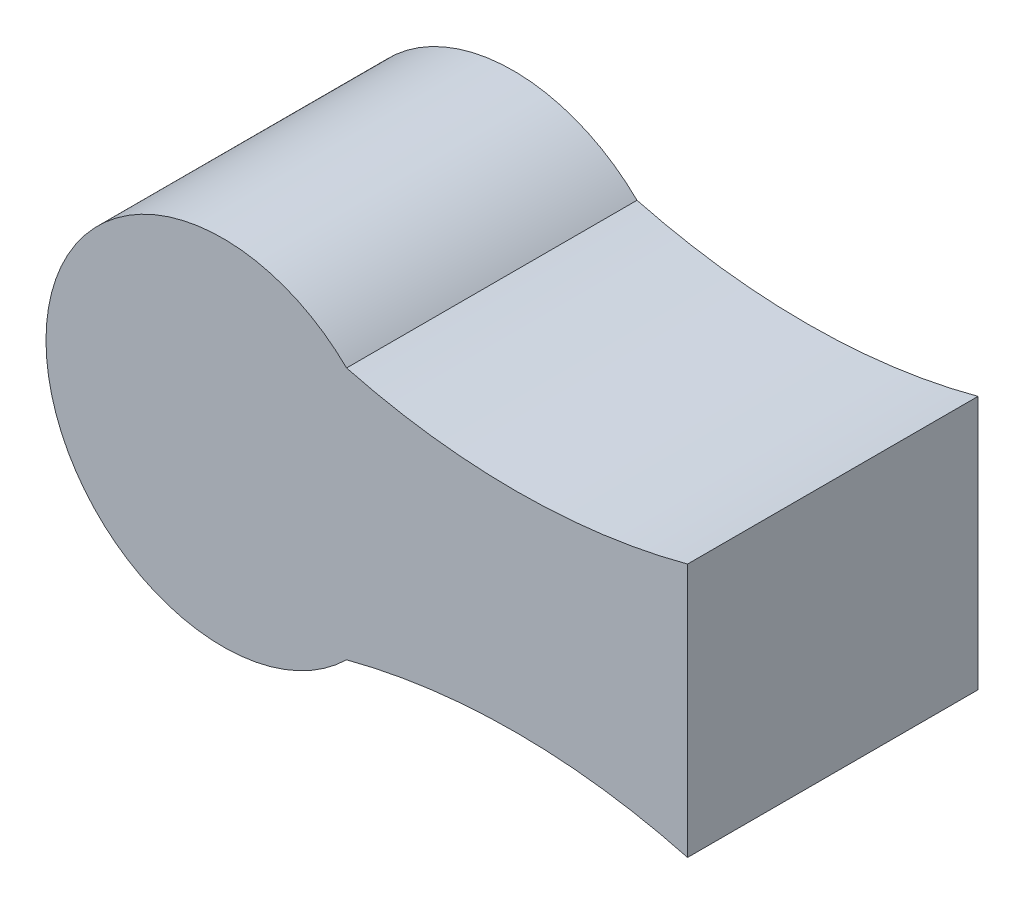
ISO-10303-21;
HEADER;
FILE_DESCRIPTION(('STEP AP214'),'2;1');
FILE_NAME('part.step','',(''),(''),'','','');
FILE_SCHEMA(('AUTOMOTIVE_DESIGN { 1 0 10303 214 1 1 1 1 }'));
ENDSEC;
DATA;
#1=APPLICATION_CONTEXT('core data for automotive mechanical design processes');
#2=APPLICATION_PROTOCOL_DEFINITION('international standard','automotive_design',2000,#1);
#3=PRODUCT_CONTEXT('',#1,'mechanical');
#4=PRODUCT('Part','Part','',(#3));
#5=PRODUCT_RELATED_PRODUCT_CATEGORY('part','',(#4));
#6=PRODUCT_DEFINITION_FORMATION('','',#4);
#7=PRODUCT_DEFINITION_CONTEXT('part definition',#1,'design');
#8=PRODUCT_DEFINITION('design','',#6,#7);
#9=PRODUCT_DEFINITION_SHAPE('','',#8);
#10=(LENGTH_UNIT() NAMED_UNIT(*) SI_UNIT(.MILLI.,.METRE.));
#11=(NAMED_UNIT(*) PLANE_ANGLE_UNIT() SI_UNIT($,.RADIAN.));
#12=(NAMED_UNIT(*) SI_UNIT($,.STERADIAN.) SOLID_ANGLE_UNIT());
#13=UNCERTAINTY_MEASURE_WITH_UNIT(LENGTH_MEASURE(1.E-05),#10,'distance_accuracy_value','');
#14=(GEOMETRIC_REPRESENTATION_CONTEXT(3) GLOBAL_UNCERTAINTY_ASSIGNED_CONTEXT((#13)) GLOBAL_UNIT_ASSIGNED_CONTEXT((#10,
#11,#12)) REPRESENTATION_CONTEXT('',''));
#15=CARTESIAN_POINT('',(0.,0.,0.));
#16=DIRECTION('',(0.,0.,1.));
#17=DIRECTION('',(1.,0.,0.));
#18=AXIS2_PLACEMENT_3D('',#15,#16,#17);
#19=CARTESIAN_POINT('',(128.170032982841,222.810691970387,80.));
#20=DIRECTION('',(0.,0.,-1.));
#21=DIRECTION('',(-1.,0.,0.));
#22=AXIS2_PLACEMENT_3D('',#19,#20,#21);
#23=CYLINDRICAL_SURFACE('',#22,183.196653412925);
#24=CARTESIAN_POINT('',(128.170032982841,222.810691970387,0.));
#25=DIRECTION('',(0.,0.,-1.));
#26=DIRECTION('',(-1.,0.,0.));
#27=AXIS2_PLACEMENT_3D('',#24,#25,#26);
#28=CIRCLE('',#27,183.196653412925);
#29=CARTESIAN_POINT('',(175.492718801523,45.8316614933225,0.));
#30=VERTEX_POINT('',#29);
#31=CARTESIAN_POINT('',(81.5700210476364,45.6400039056448,0.));
#32=VERTEX_POINT('',#31);
#33=EDGE_CURVE('E120',#30,#32,#28,.T.);
#34=ORIENTED_EDGE('',*,*,#33,.T.);
#35=DIRECTION('',(0.,0.,-1.));
#36=VECTOR('',#35,1.);
#37=CARTESIAN_POINT('',(81.5700210476364,45.6400039056448,80.));
#38=LINE('',#37,#36);
#39=CARTESIAN_POINT('',(81.5700210476364,45.6400039056448,80.));
#40=VERTEX_POINT('',#39);
#41=EDGE_CURVE('E11',#40,#32,#38,.T.);
#42=ORIENTED_EDGE('',*,*,#41,.F.);
#43=CARTESIAN_POINT('',(128.170032982841,222.810691970387,80.));
#44=DIRECTION('',(0.,0.,-1.));
#45=DIRECTION('',(-1.,0.,0.));
#46=AXIS2_PLACEMENT_3D('',#43,#44,#45);
#47=CIRCLE('',#46,183.196653412925);
#48=CARTESIAN_POINT('',(175.492718801523,45.8316614933225,80.));
#49=VERTEX_POINT('',#48);
#50=EDGE_CURVE('E151',#49,#40,#47,.T.);
#51=ORIENTED_EDGE('',*,*,#50,.F.);
#52=DIRECTION('',(0.,0.,-1.));
#53=VECTOR('',#52,1.);
#54=CARTESIAN_POINT('',(175.492718801523,45.8316614933225,80.));
#55=LINE('',#54,#53);
#56=EDGE_CURVE('E157',#49,#30,#55,.T.);
#57=ORIENTED_EDGE('',*,*,#56,.T.);
#58=EDGE_LOOP('',(#34,#42,#51,#57));
#59=FACE_BOUND('',#58,.T.);
#60=ADVANCED_FACE('F35',(#59),#23,.F.);
#61=CARTESIAN_POINT('',(47.4927188015229,10.8316614933225,80.));
#62=DIRECTION('',(0.,0.,-1.));
#63=DIRECTION('',(-1.,0.,0.));
#64=AXIS2_PLACEMENT_3D('',#61,#62,#63);
#65=CYLINDRICAL_SURFACE('',#64,48.7122492794826);
#66=CARTESIAN_POINT('',(47.4927188015229,10.8316614933225,0.));
#67=DIRECTION('',(0.,0.,1.));
#68=DIRECTION('',(1.,0.,0.));
#69=AXIS2_PLACEMENT_3D('',#66,#67,#68);
#70=CIRCLE('',#69,48.7122492794826);
#71=CARTESIAN_POINT('',(81.5700210476364,-23.9766809189998,0.));
#72=VERTEX_POINT('',#71);
#73=EDGE_CURVE('E160',#32,#72,#70,.T.);
#74=ORIENTED_EDGE('',*,*,#73,.T.);
#75=DIRECTION('',(0.,0.,-1.));
#76=VECTOR('',#75,1.);
#77=CARTESIAN_POINT('',(81.5700210476364,-23.9766809189998,80.));
#78=LINE('',#77,#76);
#79=CARTESIAN_POINT('',(81.5700210476364,-23.9766809189998,80.));
#80=VERTEX_POINT('',#79);
#81=EDGE_CURVE('E43',#80,#72,#78,.T.);
#82=ORIENTED_EDGE('',*,*,#81,.F.);
#83=CARTESIAN_POINT('',(47.4927188015229,10.8316614933225,80.));
#84=DIRECTION('',(0.,0.,1.));
#85=DIRECTION('',(1.,0.,0.));
#86=AXIS2_PLACEMENT_3D('',#83,#84,#85);
#87=CIRCLE('',#86,48.7122492794826);
#88=EDGE_CURVE('E82',#40,#80,#87,.T.);
#89=ORIENTED_EDGE('',*,*,#88,.F.);
#90=ORIENTED_EDGE('',*,*,#41,.T.);
#91=EDGE_LOOP('',(#74,#82,#89,#90));
#92=FACE_BOUND('',#91,.T.);
#93=ADVANCED_FACE('F183',(#92),#65,.T.);
#94=CARTESIAN_POINT('',(128.170032982841,-201.147368983742,80.));
#95=DIRECTION('',(0.,0.,-1.));
#96=DIRECTION('',(-1.,0.,0.));
#97=AXIS2_PLACEMENT_3D('',#94,#95,#96);
#98=CYLINDRICAL_SURFACE('',#97,183.196653412925);
#99=CARTESIAN_POINT('',(128.170032982841,-201.147368983742,0.));
#100=DIRECTION('',(0.,0.,-1.));
#101=DIRECTION('',(1.,0.,0.));
#102=AXIS2_PLACEMENT_3D('',#99,#100,#101);
#103=CIRCLE('',#102,183.196653412925);
#104=CARTESIAN_POINT('',(175.492718801523,-24.1683385066775,0.));
#105=VERTEX_POINT('',#104);
#106=EDGE_CURVE('E69',#72,#105,#103,.T.);
#107=ORIENTED_EDGE('',*,*,#106,.T.);
#108=DIRECTION('',(0.,0.,-1.));
#109=VECTOR('',#108,1.);
#110=CARTESIAN_POINT('',(175.492718801523,-24.1683385066775,80.));
#111=LINE('',#110,#109);
#112=CARTESIAN_POINT('',(175.492718801523,-24.1683385066775,80.));
#113=VERTEX_POINT('',#112);
#114=EDGE_CURVE('E165',#113,#105,#111,.T.);
#115=ORIENTED_EDGE('',*,*,#114,.F.);
#116=CARTESIAN_POINT('',(128.170032982841,-201.147368983742,80.));
#117=DIRECTION('',(0.,0.,-1.));
#118=DIRECTION('',(1.,0.,0.));
#119=AXIS2_PLACEMENT_3D('',#116,#117,#118);
#120=CIRCLE('',#119,183.196653412925);
#121=EDGE_CURVE('E154',#80,#113,#120,.T.);
#122=ORIENTED_EDGE('',*,*,#121,.F.);
#123=ORIENTED_EDGE('',*,*,#81,.T.);
#124=EDGE_LOOP('',(#107,#115,#122,#123));
#125=FACE_BOUND('',#124,.T.);
#126=ADVANCED_FACE('F167',(#125),#98,.F.);
#127=CARTESIAN_POINT('',(175.492718801523,-24.1683385066775,80.));
#128=DIRECTION('',(-1.,0.,0.));
#129=DIRECTION('',(0.,0.,1.));
#130=AXIS2_PLACEMENT_3D('',#127,#128,#129);
#131=PLANE('',#130);
#132=DIRECTION('',(0.,1.,0.));
#133=VECTOR('',#132,1.);
#134=CARTESIAN_POINT('',(175.492718801523,-24.1683385066775,0.));
#135=LINE('',#134,#133);
#136=EDGE_CURVE('E75',#105,#30,#135,.T.);
#137=ORIENTED_EDGE('',*,*,#136,.T.);
#138=ORIENTED_EDGE('',*,*,#56,.F.);
#139=DIRECTION('',(0.,1.,0.));
#140=VECTOR('',#139,1.);
#141=CARTESIAN_POINT('',(175.492718801523,-24.1683385066775,80.));
#142=LINE('',#141,#140);
#143=EDGE_CURVE('E51',#113,#49,#142,.T.);
#144=ORIENTED_EDGE('',*,*,#143,.F.);
#145=ORIENTED_EDGE('',*,*,#114,.T.);
#146=EDGE_LOOP('',(#137,#138,#144,#145));
#147=FACE_BOUND('',#146,.T.);
#148=ADVANCED_FACE('F174',(#147),#131,.F.);
#149=CARTESIAN_POINT('',(128.170032982841,222.810691970387,80.));
#150=DIRECTION('',(0.,0.,-1.));
#151=DIRECTION('',(-1.,0.,0.));
#152=AXIS2_PLACEMENT_3D('',#149,#150,#151);
#153=PLANE('',#152);
#154=ORIENTED_EDGE('',*,*,#50,.T.);
#155=ORIENTED_EDGE('',*,*,#88,.T.);
#156=ORIENTED_EDGE('',*,*,#121,.T.);
#157=ORIENTED_EDGE('',*,*,#143,.T.);
#158=EDGE_LOOP('',(#154,#155,#156,#157));
#159=FACE_BOUND('',#158,.T.);
#160=ADVANCED_FACE('F176',(#159),#153,.F.);
#161=CARTESIAN_POINT('',(128.170032982841,222.810691970387,0.));
#162=DIRECTION('',(0.,0.,-1.));
#163=DIRECTION('',(-1.,0.,0.));
#164=AXIS2_PLACEMENT_3D('',#161,#162,#163);
#165=PLANE('',#164);
#166=ORIENTED_EDGE('',*,*,#33,.F.);
#167=ORIENTED_EDGE('',*,*,#136,.F.);
#168=ORIENTED_EDGE('',*,*,#106,.F.);
#169=ORIENTED_EDGE('',*,*,#73,.F.);
#170=EDGE_LOOP('',(#166,#167,#168,#169));
#171=FACE_BOUND('',#170,.T.);
#172=ADVANCED_FACE('F170',(#171),#165,.T.);
#173=CLOSED_SHELL('',(#60,#93,#126,#148,#160,#172));
#174=CARTESIAN_POINT('',(152.998453220761,-6.96833850667748,57.8));
#175=DIRECTION('',(-1.,0.,0.));
#176=DIRECTION('',(0.,0.,1.));
#177=AXIS2_PLACEMENT_3D('',#174,#175,#176);
#178=PLANE('',#177);
#179=DIRECTION('',(0.,0.,-1.));
#180=VECTOR('',#179,1.);
#181=CARTESIAN_POINT('',(152.998453220761,-6.96833850667748,57.8));
#182=LINE('',#181,#180);
#183=CARTESIAN_POINT('',(152.998453220761,-6.96833850667748,57.8));
#184=VERTEX_POINT('',#183);
#185=CARTESIAN_POINT('',(152.998453220761,-6.96833850667748,22.2));
#186=VERTEX_POINT('',#185);
#187=EDGE_CURVE('E146',#184,#186,#182,.T.);
#188=ORIENTED_EDGE('',*,*,#187,.F.);
#189=DIRECTION('',(0.,1.,0.));
#190=VECTOR('',#189,1.);
#191=CARTESIAN_POINT('',(152.998453220761,-6.96833850667748,57.8));
#192=LINE('',#191,#190);
#193=CARTESIAN_POINT('',(152.998453220761,28.6316614933225,57.8));
#194=VERTEX_POINT('',#193);
#195=EDGE_CURVE('E118',#184,#194,#192,.T.);
#196=ORIENTED_EDGE('',*,*,#195,.T.);
#197=DIRECTION('',(0.,0.,-1.));
#198=VECTOR('',#197,1.);
#199=CARTESIAN_POINT('',(152.998453220761,28.6316614933225,57.8));
#200=LINE('',#199,#198);
#201=CARTESIAN_POINT('',(152.998453220761,28.6316614933225,22.2));
#202=VERTEX_POINT('',#201);
#203=EDGE_CURVE('E110',#194,#202,#200,.T.);
#204=ORIENTED_EDGE('',*,*,#203,.T.);
#205=DIRECTION('',(0.,1.,0.));
#206=VECTOR('',#205,1.);
#207=CARTESIAN_POINT('',(152.998453220761,-6.96833850667748,22.2));
#208=LINE('',#207,#206);
#209=EDGE_CURVE('E115',#186,#202,#208,.T.);
#210=ORIENTED_EDGE('',*,*,#209,.F.);
#211=EDGE_LOOP('',(#188,#196,#204,#210));
#212=FACE_BOUND('',#211,.T.);
#213=ADVANCED_FACE('F113',(#212),#178,.T.);
#214=CARTESIAN_POINT('',(117.398453220761,28.6316614933225,57.8));
#215=DIRECTION('',(0.,-1.,0.));
#216=DIRECTION('',(0.,0.,-1.));
#217=AXIS2_PLACEMENT_3D('',#214,#215,#216);
#218=PLANE('',#217);
#219=ORIENTED_EDGE('',*,*,#203,.F.);
#220=DIRECTION('',(-1.,0.,0.));
#221=VECTOR('',#220,1.);
#222=CARTESIAN_POINT('',(117.398453220761,28.6316614933225,57.8));
#223=LINE('',#222,#221);
#224=CARTESIAN_POINT('',(117.398453220761,28.6316614933225,57.8));
#225=VERTEX_POINT('',#224);
#226=EDGE_CURVE('E140',#194,#225,#223,.T.);
#227=ORIENTED_EDGE('',*,*,#226,.T.);
#228=DIRECTION('',(0.,0.,-1.));
#229=VECTOR('',#228,1.);
#230=CARTESIAN_POINT('',(117.398453220761,28.6316614933225,57.8));
#231=LINE('',#230,#229);
#232=CARTESIAN_POINT('',(117.398453220761,28.6316614933225,22.2));
#233=VERTEX_POINT('',#232);
#234=EDGE_CURVE('E121',#225,#233,#231,.T.);
#235=ORIENTED_EDGE('',*,*,#234,.T.);
#236=DIRECTION('',(-1.,0.,0.));
#237=VECTOR('',#236,1.);
#238=CARTESIAN_POINT('',(117.398453220761,28.6316614933225,22.2));
#239=LINE('',#238,#237);
#240=EDGE_CURVE('E124',#202,#233,#239,.T.);
#241=ORIENTED_EDGE('',*,*,#240,.F.);
#242=EDGE_LOOP('',(#219,#227,#235,#241));
#243=FACE_BOUND('',#242,.T.);
#244=ADVANCED_FACE('F125',(#243),#218,.T.);
#245=CARTESIAN_POINT('',(117.398453220761,-6.96833850667748,57.8));
#246=DIRECTION('',(1.,0.,0.));
#247=DIRECTION('',(0.,0.,-1.));
#248=AXIS2_PLACEMENT_3D('',#245,#246,#247);
#249=PLANE('',#248);
#250=ORIENTED_EDGE('',*,*,#234,.F.);
#251=DIRECTION('',(0.,-1.,0.));
#252=VECTOR('',#251,1.);
#253=CARTESIAN_POINT('',(117.398453220761,-6.96833850667748,57.8));
#254=LINE('',#253,#252);
#255=CARTESIAN_POINT('',(117.398453220761,-6.96833850667748,57.8));
#256=VERTEX_POINT('',#255);
#257=EDGE_CURVE('E142',#225,#256,#254,.T.);
#258=ORIENTED_EDGE('',*,*,#257,.T.);
#259=DIRECTION('',(0.,0.,-1.));
#260=VECTOR('',#259,1.);
#261=CARTESIAN_POINT('',(117.398453220761,-6.96833850667748,57.8));
#262=LINE('',#261,#260);
#263=CARTESIAN_POINT('',(117.398453220761,-6.96833850667748,22.2));
#264=VERTEX_POINT('',#263);
#265=EDGE_CURVE('E148',#256,#264,#262,.T.);
#266=ORIENTED_EDGE('',*,*,#265,.T.);
#267=DIRECTION('',(0.,-1.,0.));
#268=VECTOR('',#267,1.);
#269=CARTESIAN_POINT('',(117.398453220761,-6.96833850667748,22.2));
#270=LINE('',#269,#268);
#271=EDGE_CURVE('E130',#233,#264,#270,.T.);
#272=ORIENTED_EDGE('',*,*,#271,.F.);
#273=EDGE_LOOP('',(#250,#258,#266,#272));
#274=FACE_BOUND('',#273,.T.);
#275=ADVANCED_FACE('F231',(#274),#249,.T.);
#276=CARTESIAN_POINT('',(117.398453220761,-6.96833850667748,57.8));
#277=DIRECTION('',(0.,1.,0.));
#278=DIRECTION('',(0.,0.,1.));
#279=AXIS2_PLACEMENT_3D('',#276,#277,#278);
#280=PLANE('',#279);
#281=ORIENTED_EDGE('',*,*,#265,.F.);
#282=DIRECTION('',(1.,0.,0.));
#283=VECTOR('',#282,1.);
#284=CARTESIAN_POINT('',(117.398453220761,-6.96833850667748,57.8));
#285=LINE('',#284,#283);
#286=EDGE_CURVE('E144',#256,#184,#285,.T.);
#287=ORIENTED_EDGE('',*,*,#286,.T.);
#288=ORIENTED_EDGE('',*,*,#187,.T.);
#289=DIRECTION('',(1.,0.,0.));
#290=VECTOR('',#289,1.);
#291=CARTESIAN_POINT('',(117.398453220761,-6.96833850667748,22.2));
#292=LINE('',#291,#290);
#293=EDGE_CURVE('E134',#264,#186,#292,.T.);
#294=ORIENTED_EDGE('',*,*,#293,.F.);
#295=EDGE_LOOP('',(#281,#287,#288,#294));
#296=FACE_BOUND('',#295,.T.);
#297=ADVANCED_FACE('F240',(#296),#280,.T.);
#298=CARTESIAN_POINT('',(0.,0.,57.8));
#299=DIRECTION('',(0.,0.,-1.));
#300=DIRECTION('',(-1.,0.,0.));
#301=AXIS2_PLACEMENT_3D('',#298,#299,#300);
#302=PLANE('',#301);
#303=ORIENTED_EDGE('',*,*,#195,.F.);
#304=ORIENTED_EDGE('',*,*,#286,.F.);
#305=ORIENTED_EDGE('',*,*,#257,.F.);
#306=ORIENTED_EDGE('',*,*,#226,.F.);
#307=EDGE_LOOP('',(#303,#304,#305,#306));
#308=FACE_BOUND('',#307,.T.);
#309=ADVANCED_FACE('F250',(#308),#302,.T.);
#310=CARTESIAN_POINT('',(0.,0.,22.2));
#311=DIRECTION('',(0.,0.,-1.));
#312=DIRECTION('',(-1.,0.,0.));
#313=AXIS2_PLACEMENT_3D('',#310,#311,#312);
#314=PLANE('',#313);
#315=ORIENTED_EDGE('',*,*,#209,.T.);
#316=ORIENTED_EDGE('',*,*,#240,.T.);
#317=ORIENTED_EDGE('',*,*,#271,.T.);
#318=ORIENTED_EDGE('',*,*,#293,.T.);
#319=EDGE_LOOP('',(#315,#316,#317,#318));
#320=FACE_BOUND('',#319,.T.);
#321=ADVANCED_FACE('F132',(#320),#314,.F.);
#322=CLOSED_SHELL('',(#213,#244,#275,#297,#309,#321));
#323=ORIENTED_CLOSED_SHELL('',*,#322,.T.);
#324=BREP_WITH_VOIDS('B2',#173,(#323));
#325=ADVANCED_BREP_SHAPE_REPRESENTATION('',(#18,#324),#14);
#326=SHAPE_DEFINITION_REPRESENTATION(#9,#325);
ENDSEC;
END-ISO-10303-21;
